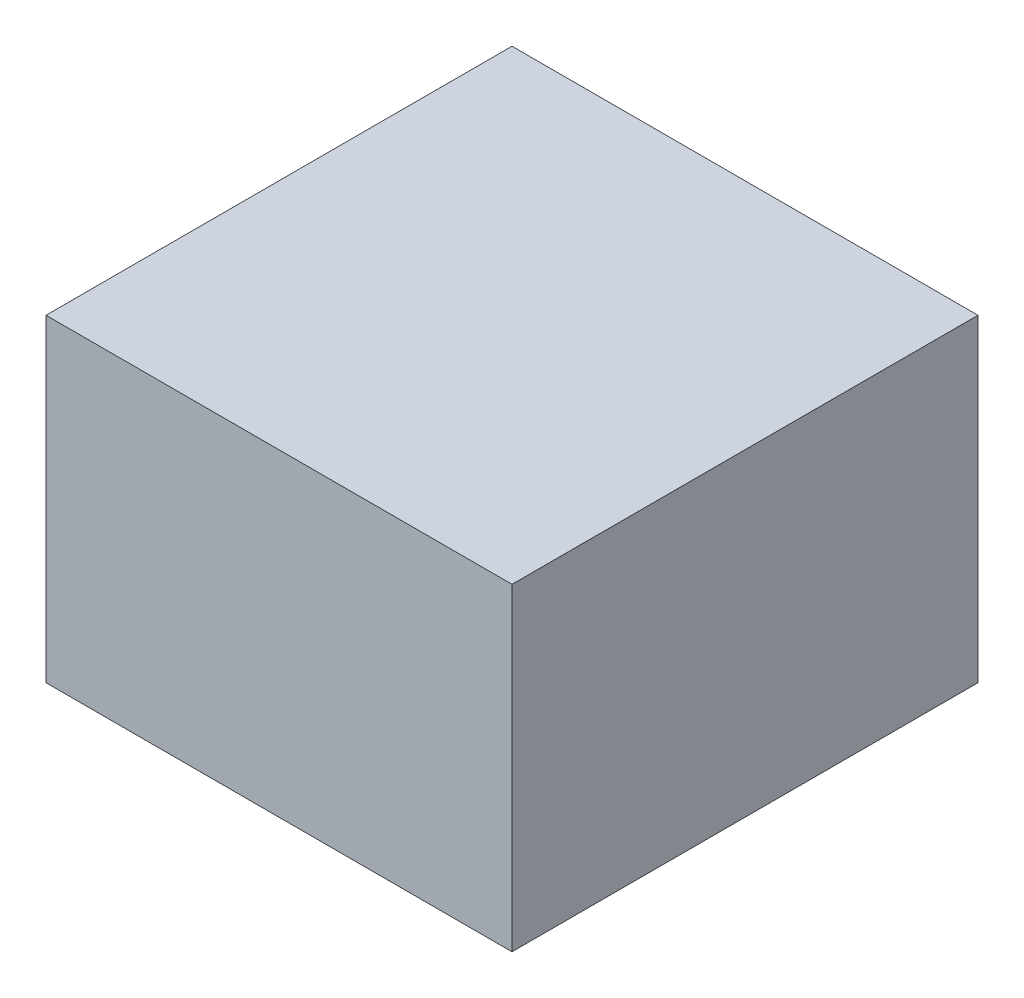
ISO-10303-21;
HEADER;
FILE_DESCRIPTION(('STEP AP214'),'2;1');
FILE_NAME('part.step','',(''),(''),'','','');
FILE_SCHEMA(('AUTOMOTIVE_DESIGN { 1 0 10303 214 1 1 1 1 }'));
ENDSEC;
DATA;
#1=APPLICATION_CONTEXT('core data for automotive mechanical design processes');
#2=APPLICATION_PROTOCOL_DEFINITION('international standard','automotive_design',2000,#1);
#3=PRODUCT_CONTEXT('',#1,'mechanical');
#4=PRODUCT('Part','Part','',(#3));
#5=PRODUCT_RELATED_PRODUCT_CATEGORY('part','',(#4));
#6=PRODUCT_DEFINITION_FORMATION('','',#4);
#7=PRODUCT_DEFINITION_CONTEXT('part definition',#1,'design');
#8=PRODUCT_DEFINITION('design','',#6,#7);
#9=PRODUCT_DEFINITION_SHAPE('','',#8);
#10=(LENGTH_UNIT() NAMED_UNIT(*) SI_UNIT(.MILLI.,.METRE.));
#11=(NAMED_UNIT(*) PLANE_ANGLE_UNIT() SI_UNIT($,.RADIAN.));
#12=(NAMED_UNIT(*) SI_UNIT($,.STERADIAN.) SOLID_ANGLE_UNIT());
#13=UNCERTAINTY_MEASURE_WITH_UNIT(LENGTH_MEASURE(1.E-05),#10,'distance_accuracy_value','');
#14=(GEOMETRIC_REPRESENTATION_CONTEXT(3) GLOBAL_UNCERTAINTY_ASSIGNED_CONTEXT((#13)) GLOBAL_UNIT_ASSIGNED_CONTEXT((#10,
#11,#12)) REPRESENTATION_CONTEXT('',''));
#15=CARTESIAN_POINT('',(0.,0.,0.));
#16=DIRECTION('',(0.,0.,1.));
#17=DIRECTION('',(1.,0.,0.));
#18=AXIS2_PLACEMENT_3D('',#15,#16,#17);
#19=CARTESIAN_POINT('',(-32.8,22.4,-32.8));
#20=DIRECTION('',(1.,0.,0.));
#21=DIRECTION('',(0.,0.,-1.));
#22=AXIS2_PLACEMENT_3D('',#19,#20,#21);
#23=PLANE('',#22);
#24=DIRECTION('',(0.,0.,1.));
#25=VECTOR('',#24,1.);
#26=CARTESIAN_POINT('',(-32.8,-22.4,-32.8));
#27=LINE('',#26,#25);
#28=CARTESIAN_POINT('',(-32.8,-22.4,-32.8));
#29=VERTEX_POINT('',#28);
#30=CARTESIAN_POINT('',(-32.8,-22.4,32.8));
#31=VERTEX_POINT('',#30);
#32=EDGE_CURVE('E113',#29,#31,#27,.T.);
#33=ORIENTED_EDGE('',*,*,#32,.T.);
#34=DIRECTION('',(0.,-1.,0.));
#35=VECTOR('',#34,1.);
#36=CARTESIAN_POINT('',(-32.8,22.4,32.8));
#37=LINE('',#36,#35);
#38=CARTESIAN_POINT('',(-32.8,22.4,32.8));
#39=VERTEX_POINT('',#38);
#40=EDGE_CURVE('E11',#39,#31,#37,.T.);
#41=ORIENTED_EDGE('',*,*,#40,.F.);
#42=DIRECTION('',(0.,0.,1.));
#43=VECTOR('',#42,1.);
#44=CARTESIAN_POINT('',(-32.8,22.4,-32.8));
#45=LINE('',#44,#43);
#46=CARTESIAN_POINT('',(-32.8,22.4,-32.8));
#47=VERTEX_POINT('',#46);
#48=EDGE_CURVE('E97',#47,#39,#45,.T.);
#49=ORIENTED_EDGE('',*,*,#48,.F.);
#50=DIRECTION('',(0.,-1.,0.));
#51=VECTOR('',#50,1.);
#52=CARTESIAN_POINT('',(-32.8,22.4,-32.8));
#53=LINE('',#52,#51);
#54=EDGE_CURVE('E109',#47,#29,#53,.T.);
#55=ORIENTED_EDGE('',*,*,#54,.T.);
#56=EDGE_LOOP('',(#33,#41,#49,#55));
#57=FACE_BOUND('',#56,.T.);
#58=ADVANCED_FACE('F45',(#57),#23,.F.);
#59=CARTESIAN_POINT('',(-32.8,22.4,32.8));
#60=DIRECTION('',(0.,0.,-1.));
#61=DIRECTION('',(-1.,0.,0.));
#62=AXIS2_PLACEMENT_3D('',#59,#60,#61);
#63=PLANE('',#62);
#64=DIRECTION('',(1.,0.,0.));
#65=VECTOR('',#64,1.);
#66=CARTESIAN_POINT('',(-32.8,-22.4,32.8));
#67=LINE('',#66,#65);
#68=CARTESIAN_POINT('',(32.8,-22.4,32.8));
#69=VERTEX_POINT('',#68);
#70=EDGE_CURVE('E102',#31,#69,#67,.T.);
#71=ORIENTED_EDGE('',*,*,#70,.T.);
#72=DIRECTION('',(0.,-1.,0.));
#73=VECTOR('',#72,1.);
#74=CARTESIAN_POINT('',(32.8,22.4,32.8));
#75=LINE('',#74,#73);
#76=CARTESIAN_POINT('',(32.8,22.4,32.8));
#77=VERTEX_POINT('',#76);
#78=EDGE_CURVE('E54',#77,#69,#75,.T.);
#79=ORIENTED_EDGE('',*,*,#78,.F.);
#80=DIRECTION('',(1.,0.,0.));
#81=VECTOR('',#80,1.);
#82=CARTESIAN_POINT('',(-32.8,22.4,32.8));
#83=LINE('',#82,#81);
#84=EDGE_CURVE('E92',#39,#77,#83,.T.);
#85=ORIENTED_EDGE('',*,*,#84,.F.);
#86=ORIENTED_EDGE('',*,*,#40,.T.);
#87=EDGE_LOOP('',(#71,#79,#85,#86));
#88=FACE_BOUND('',#87,.T.);
#89=ADVANCED_FACE('F101',(#88),#63,.F.);
#90=CARTESIAN_POINT('',(32.8,22.4,-32.8));
#91=DIRECTION('',(-1.,0.,0.));
#92=DIRECTION('',(0.,0.,1.));
#93=AXIS2_PLACEMENT_3D('',#90,#91,#92);
#94=PLANE('',#93);
#95=DIRECTION('',(0.,0.,-1.));
#96=VECTOR('',#95,1.);
#97=CARTESIAN_POINT('',(32.8,-22.4,-32.8));
#98=LINE('',#97,#96);
#99=CARTESIAN_POINT('',(32.8,-22.4,-32.8));
#100=VERTEX_POINT('',#99);
#101=EDGE_CURVE('E79',#69,#100,#98,.T.);
#102=ORIENTED_EDGE('',*,*,#101,.T.);
#103=DIRECTION('',(0.,-1.,0.));
#104=VECTOR('',#103,1.);
#105=CARTESIAN_POINT('',(32.8,22.4,-32.8));
#106=LINE('',#105,#104);
#107=CARTESIAN_POINT('',(32.8,22.4,-32.8));
#108=VERTEX_POINT('',#107);
#109=EDGE_CURVE('E104',#108,#100,#106,.T.);
#110=ORIENTED_EDGE('',*,*,#109,.F.);
#111=DIRECTION('',(0.,0.,-1.));
#112=VECTOR('',#111,1.);
#113=CARTESIAN_POINT('',(32.8,22.4,-32.8));
#114=LINE('',#113,#112);
#115=EDGE_CURVE('E95',#77,#108,#114,.T.);
#116=ORIENTED_EDGE('',*,*,#115,.F.);
#117=ORIENTED_EDGE('',*,*,#78,.T.);
#118=EDGE_LOOP('',(#102,#110,#116,#117));
#119=FACE_BOUND('',#118,.T.);
#120=ADVANCED_FACE('F105',(#119),#94,.F.);
#121=CARTESIAN_POINT('',(-32.8,22.4,-32.8));
#122=DIRECTION('',(0.,0.,1.));
#123=DIRECTION('',(1.,0.,0.));
#124=AXIS2_PLACEMENT_3D('',#121,#122,#123);
#125=PLANE('',#124);
#126=DIRECTION('',(-1.,0.,0.));
#127=VECTOR('',#126,1.);
#128=CARTESIAN_POINT('',(-32.8,-22.4,-32.8));
#129=LINE('',#128,#127);
#130=EDGE_CURVE('E85',#100,#29,#129,.T.);
#131=ORIENTED_EDGE('',*,*,#130,.T.);
#132=ORIENTED_EDGE('',*,*,#54,.F.);
#133=DIRECTION('',(-1.,0.,0.));
#134=VECTOR('',#133,1.);
#135=CARTESIAN_POINT('',(-32.8,22.4,-32.8));
#136=LINE('',#135,#134);
#137=EDGE_CURVE('E62',#108,#47,#136,.T.);
#138=ORIENTED_EDGE('',*,*,#137,.F.);
#139=ORIENTED_EDGE('',*,*,#109,.T.);
#140=EDGE_LOOP('',(#131,#132,#138,#139));
#141=FACE_BOUND('',#140,.T.);
#142=ADVANCED_FACE('F126',(#141),#125,.F.);
#143=CARTESIAN_POINT('',(0.,22.4,0.));
#144=DIRECTION('',(0.,1.,0.));
#145=DIRECTION('',(0.,0.,1.));
#146=AXIS2_PLACEMENT_3D('',#143,#144,#145);
#147=PLANE('',#146);
#148=ORIENTED_EDGE('',*,*,#48,.T.);
#149=ORIENTED_EDGE('',*,*,#84,.T.);
#150=ORIENTED_EDGE('',*,*,#115,.T.);
#151=ORIENTED_EDGE('',*,*,#137,.T.);
#152=EDGE_LOOP('',(#148,#149,#150,#151));
#153=FACE_BOUND('',#152,.T.);
#154=ADVANCED_FACE('F93',(#153),#147,.T.);
#155=CARTESIAN_POINT('',(0.,-22.4,0.));
#156=DIRECTION('',(0.,1.,0.));
#157=DIRECTION('',(0.,0.,1.));
#158=AXIS2_PLACEMENT_3D('',#155,#156,#157);
#159=PLANE('',#158);
#160=ORIENTED_EDGE('',*,*,#32,.F.);
#161=ORIENTED_EDGE('',*,*,#130,.F.);
#162=ORIENTED_EDGE('',*,*,#101,.F.);
#163=ORIENTED_EDGE('',*,*,#70,.F.);
#164=EDGE_LOOP('',(#160,#161,#162,#163));
#165=FACE_BOUND('',#164,.T.);
#166=ADVANCED_FACE('F129',(#165),#159,.F.);
#167=CLOSED_SHELL('',(#58,#89,#120,#142,#154,#166));
#168=MANIFOLD_SOLID_BREP('B2',#167);
#169=ADVANCED_BREP_SHAPE_REPRESENTATION('',(#18,#168),#14);
#170=SHAPE_DEFINITION_REPRESENTATION(#9,#169);
ENDSEC;
END-ISO-10303-21;
